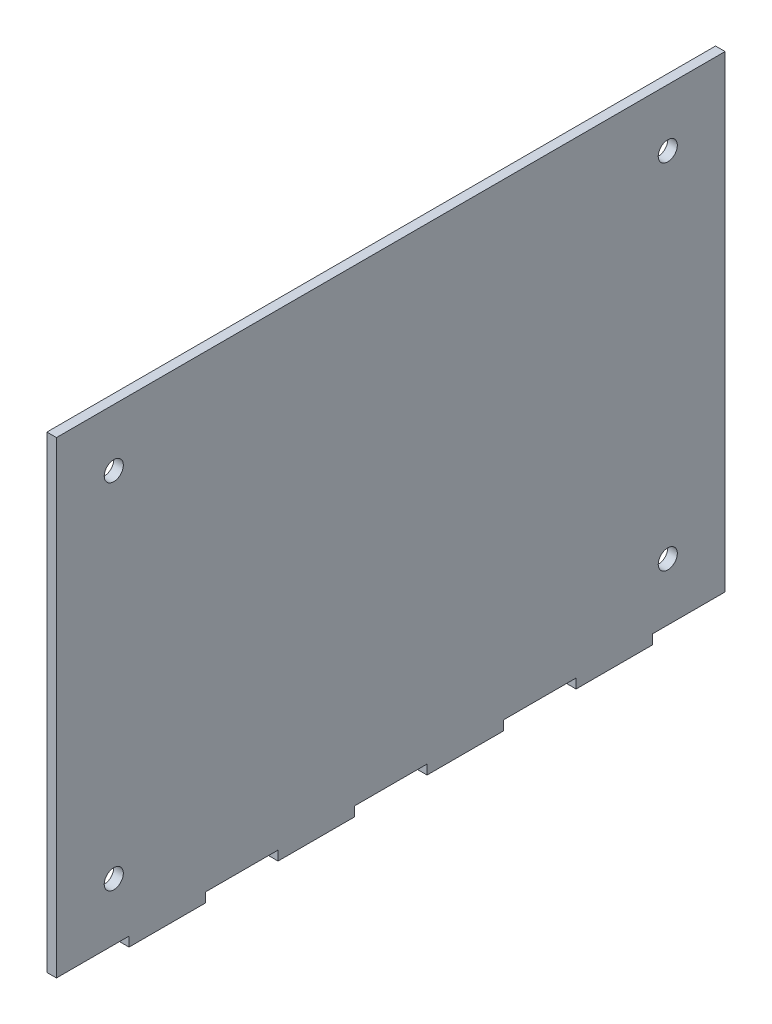
ISO-10303-21;
HEADER;
FILE_DESCRIPTION(('STEP AP214'),'2;1');
FILE_NAME('part.step','',(''),(''),'','','');
FILE_SCHEMA(('AUTOMOTIVE_DESIGN { 1 0 10303 214 1 1 1 1 }'));
ENDSEC;
DATA;
#1=APPLICATION_CONTEXT('core data for automotive mechanical design processes');
#2=APPLICATION_PROTOCOL_DEFINITION('international standard','automotive_design',2000,#1);
#3=PRODUCT_CONTEXT('',#1,'mechanical');
#4=PRODUCT('Part','Part','',(#3));
#5=PRODUCT_RELATED_PRODUCT_CATEGORY('part','',(#4));
#6=PRODUCT_DEFINITION_FORMATION('','',#4);
#7=PRODUCT_DEFINITION_CONTEXT('part definition',#1,'design');
#8=PRODUCT_DEFINITION('design','',#6,#7);
#9=PRODUCT_DEFINITION_SHAPE('','',#8);
#10=(LENGTH_UNIT() NAMED_UNIT(*) SI_UNIT(.MILLI.,.METRE.));
#11=(NAMED_UNIT(*) PLANE_ANGLE_UNIT() SI_UNIT($,.RADIAN.));
#12=(NAMED_UNIT(*) SI_UNIT($,.STERADIAN.) SOLID_ANGLE_UNIT());
#13=UNCERTAINTY_MEASURE_WITH_UNIT(LENGTH_MEASURE(1.E-05),#10,'distance_accuracy_value','');
#14=(GEOMETRIC_REPRESENTATION_CONTEXT(3) GLOBAL_UNCERTAINTY_ASSIGNED_CONTEXT((#13)) GLOBAL_UNIT_ASSIGNED_CONTEXT((#10,
#11,#12)) REPRESENTATION_CONTEXT('',''));
#15=CARTESIAN_POINT('',(0.,0.,0.));
#16=DIRECTION('',(0.,0.,1.));
#17=DIRECTION('',(1.,0.,0.));
#18=AXIS2_PLACEMENT_3D('',#15,#16,#17);
#19=CARTESIAN_POINT('',(5.,0.,-175.));
#20=DIRECTION('',(0.,1.,0.));
#21=DIRECTION('',(0.,0.,1.));
#22=AXIS2_PLACEMENT_3D('',#19,#20,#21);
#23=PLANE('',#22);
#24=DIRECTION('',(0.,0.,-1.));
#25=VECTOR('',#24,1.);
#26=CARTESIAN_POINT('',(5.,0.,-175.));
#27=LINE('',#26,#25);
#28=CARTESIAN_POINT('',(5.,0.,137.));
#29=VERTEX_POINT('',#28);
#30=CARTESIAN_POINT('',(5.,0.,97.));
#31=VERTEX_POINT('',#30);
#32=EDGE_CURVE('E187',#29,#31,#27,.T.);
#33=ORIENTED_EDGE('',*,*,#32,.F.);
#34=DIRECTION('',(1.,0.,0.));
#35=VECTOR('',#34,1.);
#36=CARTESIAN_POINT('',(0.,0.,137.));
#37=LINE('',#36,#35);
#38=CARTESIAN_POINT('',(0.,0.,137.));
#39=VERTEX_POINT('',#38);
#40=EDGE_CURVE('E174',#39,#29,#37,.T.);
#41=ORIENTED_EDGE('',*,*,#40,.F.);
#42=DIRECTION('',(0.,0.,-1.));
#43=VECTOR('',#42,1.);
#44=CARTESIAN_POINT('',(0.,0.,-175.));
#45=LINE('',#44,#43);
#46=CARTESIAN_POINT('',(0.,0.,97.));
#47=VERTEX_POINT('',#46);
#48=EDGE_CURVE('E185',#39,#47,#45,.T.);
#49=ORIENTED_EDGE('',*,*,#48,.T.);
#50=DIRECTION('',(1.,0.,0.));
#51=VECTOR('',#50,1.);
#52=CARTESIAN_POINT('',(0.,0.,97.));
#53=LINE('',#52,#51);
#54=EDGE_CURVE('E299',#47,#31,#53,.T.);
#55=ORIENTED_EDGE('',*,*,#54,.T.);
#56=EDGE_LOOP('',(#33,#41,#49,#55));
#57=FACE_BOUND('',#56,.T.);
#58=ADVANCED_FACE('F34',(#57),#23,.F.);
#59=CARTESIAN_POINT('',(5.,0.,-19.));
#60=VERTEX_POINT('',#59);
#61=CARTESIAN_POINT('',(5.,0.,-59.));
#62=VERTEX_POINT('',#61);
#63=EDGE_CURVE('E224',#60,#62,#27,.T.);
#64=ORIENTED_EDGE('',*,*,#63,.F.);
#65=DIRECTION('',(1.,0.,0.));
#66=VECTOR('',#65,1.);
#67=CARTESIAN_POINT('',(0.,0.,-19.));
#68=LINE('',#67,#66);
#69=CARTESIAN_POINT('',(0.,0.,-19.));
#70=VERTEX_POINT('',#69);
#71=EDGE_CURVE('E281',#70,#60,#68,.T.);
#72=ORIENTED_EDGE('',*,*,#71,.F.);
#73=CARTESIAN_POINT('',(0.,0.,-59.));
#74=VERTEX_POINT('',#73);
#75=EDGE_CURVE('E200',#70,#74,#45,.T.);
#76=ORIENTED_EDGE('',*,*,#75,.T.);
#77=DIRECTION('',(1.,0.,0.));
#78=VECTOR('',#77,1.);
#79=CARTESIAN_POINT('',(0.,0.,-59.));
#80=LINE('',#79,#78);
#81=EDGE_CURVE('E249',#74,#62,#80,.T.);
#82=ORIENTED_EDGE('',*,*,#81,.T.);
#83=EDGE_LOOP('',(#64,#72,#76,#82));
#84=FACE_BOUND('',#83,.T.);
#85=ADVANCED_FACE('F404',(#84),#23,.F.);
#86=CARTESIAN_POINT('',(5.,0.,-97.));
#87=VERTEX_POINT('',#86);
#88=CARTESIAN_POINT('',(5.,0.,-137.));
#89=VERTEX_POINT('',#88);
#90=EDGE_CURVE('E221',#87,#89,#27,.T.);
#91=ORIENTED_EDGE('',*,*,#90,.F.);
#92=DIRECTION('',(1.,0.,0.));
#93=VECTOR('',#92,1.);
#94=CARTESIAN_POINT('',(0.,0.,-97.));
#95=LINE('',#94,#93);
#96=CARTESIAN_POINT('',(0.,0.,-97.));
#97=VERTEX_POINT('',#96);
#98=EDGE_CURVE('E253',#97,#87,#95,.T.);
#99=ORIENTED_EDGE('',*,*,#98,.F.);
#100=CARTESIAN_POINT('',(0.,0.,-137.));
#101=VERTEX_POINT('',#100);
#102=EDGE_CURVE('E196',#97,#101,#45,.T.);
#103=ORIENTED_EDGE('',*,*,#102,.T.);
#104=DIRECTION('',(1.,0.,0.));
#105=VECTOR('',#104,1.);
#106=CARTESIAN_POINT('',(0.,0.,-137.));
#107=LINE('',#106,#105);
#108=EDGE_CURVE('E230',#101,#89,#107,.T.);
#109=ORIENTED_EDGE('',*,*,#108,.T.);
#110=EDGE_LOOP('',(#91,#99,#103,#109));
#111=FACE_BOUND('',#110,.T.);
#112=ADVANCED_FACE('F389',(#111),#23,.F.);
#113=CARTESIAN_POINT('',(5.,0.,175.));
#114=DIRECTION('',(0.,0.,-1.));
#115=DIRECTION('',(0.,1.,0.));
#116=AXIS2_PLACEMENT_3D('',#113,#114,#115);
#117=PLANE('',#116);
#118=DIRECTION('',(0.,-1.,0.));
#119=VECTOR('',#118,1.);
#120=CARTESIAN_POINT('',(0.,0.,175.));
#121=LINE('',#120,#119);
#122=CARTESIAN_POINT('',(0.,250.,175.));
#123=VERTEX_POINT('',#122);
#124=CARTESIAN_POINT('',(0.,5.,175.));
#125=VERTEX_POINT('',#124);
#126=EDGE_CURVE('E203',#123,#125,#121,.T.);
#127=ORIENTED_EDGE('',*,*,#126,.T.);
#128=DIRECTION('',(1.,0.,0.));
#129=VECTOR('',#128,1.);
#130=CARTESIAN_POINT('',(0.,5.,175.));
#131=LINE('',#130,#129);
#132=CARTESIAN_POINT('',(5.,5.,175.));
#133=VERTEX_POINT('',#132);
#134=EDGE_CURVE('E210',#125,#133,#131,.T.);
#135=ORIENTED_EDGE('',*,*,#134,.T.);
#136=DIRECTION('',(0.,-1.,0.));
#137=VECTOR('',#136,1.);
#138=CARTESIAN_POINT('',(5.,0.,175.));
#139=LINE('',#138,#137);
#140=CARTESIAN_POINT('',(5.,250.,175.));
#141=VERTEX_POINT('',#140);
#142=EDGE_CURVE('E225',#141,#133,#139,.T.);
#143=ORIENTED_EDGE('',*,*,#142,.F.);
#144=DIRECTION('',(-1.,0.,0.));
#145=VECTOR('',#144,1.);
#146=CARTESIAN_POINT('',(5.,250.,175.));
#147=LINE('',#146,#145);
#148=EDGE_CURVE('E42',#141,#123,#147,.T.);
#149=ORIENTED_EDGE('',*,*,#148,.T.);
#150=EDGE_LOOP('',(#127,#135,#143,#149));
#151=FACE_BOUND('',#150,.T.);
#152=ADVANCED_FACE('F36',(#151),#117,.F.);
#153=CARTESIAN_POINT('',(5.,0.,59.));
#154=VERTEX_POINT('',#153);
#155=CARTESIAN_POINT('',(5.,0.,19.));
#156=VERTEX_POINT('',#155);
#157=EDGE_CURVE('E422',#154,#156,#27,.T.);
#158=ORIENTED_EDGE('',*,*,#157,.F.);
#159=DIRECTION('',(1.,0.,0.));
#160=VECTOR('',#159,1.);
#161=CARTESIAN_POINT('',(0.,0.,59.));
#162=LINE('',#161,#160);
#163=CARTESIAN_POINT('',(0.,0.,59.));
#164=VERTEX_POINT('',#163);
#165=EDGE_CURVE('E301',#164,#154,#162,.T.);
#166=ORIENTED_EDGE('',*,*,#165,.F.);
#167=CARTESIAN_POINT('',(0.,0.,19.));
#168=VERTEX_POINT('',#167);
#169=EDGE_CURVE('E194',#164,#168,#45,.T.);
#170=ORIENTED_EDGE('',*,*,#169,.T.);
#171=DIRECTION('',(1.,0.,0.));
#172=VECTOR('',#171,1.);
#173=CARTESIAN_POINT('',(0.,0.,19.));
#174=LINE('',#173,#172);
#175=EDGE_CURVE('E278',#168,#156,#174,.T.);
#176=ORIENTED_EDGE('',*,*,#175,.T.);
#177=EDGE_LOOP('',(#158,#166,#170,#176));
#178=FACE_BOUND('',#177,.T.);
#179=ADVANCED_FACE('F421',(#178),#23,.F.);
#180=CARTESIAN_POINT('',(5.,0.,-175.));
#181=DIRECTION('',(0.,0.,1.));
#182=DIRECTION('',(0.,-1.,0.));
#183=AXIS2_PLACEMENT_3D('',#180,#181,#182);
#184=PLANE('',#183);
#185=DIRECTION('',(0.,1.,0.));
#186=VECTOR('',#185,1.);
#187=CARTESIAN_POINT('',(5.,0.,-175.));
#188=LINE('',#187,#186);
#189=CARTESIAN_POINT('',(5.,5.,-175.));
#190=VERTEX_POINT('',#189);
#191=CARTESIAN_POINT('',(5.,250.,-175.));
#192=VERTEX_POINT('',#191);
#193=EDGE_CURVE('E219',#190,#192,#188,.T.);
#194=ORIENTED_EDGE('',*,*,#193,.F.);
#195=DIRECTION('',(1.,0.,0.));
#196=VECTOR('',#195,1.);
#197=CARTESIAN_POINT('',(0.,5.,-175.));
#198=LINE('',#197,#196);
#199=CARTESIAN_POINT('',(0.,5.,-175.));
#200=VERTEX_POINT('',#199);
#201=EDGE_CURVE('E233',#200,#190,#198,.T.);
#202=ORIENTED_EDGE('',*,*,#201,.F.);
#203=DIRECTION('',(0.,1.,0.));
#204=VECTOR('',#203,1.);
#205=CARTESIAN_POINT('',(0.,0.,-175.));
#206=LINE('',#205,#204);
#207=CARTESIAN_POINT('',(0.,250.,-175.));
#208=VERTEX_POINT('',#207);
#209=EDGE_CURVE('E193',#200,#208,#206,.T.);
#210=ORIENTED_EDGE('',*,*,#209,.T.);
#211=DIRECTION('',(-1.,0.,0.));
#212=VECTOR('',#211,1.);
#213=CARTESIAN_POINT('',(5.,250.,-175.));
#214=LINE('',#213,#212);
#215=EDGE_CURVE('E11',#192,#208,#214,.T.);
#216=ORIENTED_EDGE('',*,*,#215,.F.);
#217=EDGE_LOOP('',(#194,#202,#210,#216));
#218=FACE_BOUND('',#217,.T.);
#219=ADVANCED_FACE('F378',(#218),#184,.F.);
#220=CARTESIAN_POINT('',(5.,250.,175.));
#221=DIRECTION('',(0.,-1.,0.));
#222=DIRECTION('',(0.,0.,-1.));
#223=AXIS2_PLACEMENT_3D('',#220,#221,#222);
#224=PLANE('',#223);
#225=DIRECTION('',(0.,0.,1.));
#226=VECTOR('',#225,1.);
#227=CARTESIAN_POINT('',(0.,250.,175.));
#228=LINE('',#227,#226);
#229=EDGE_CURVE('E197',#208,#123,#228,.T.);
#230=ORIENTED_EDGE('',*,*,#229,.T.);
#231=ORIENTED_EDGE('',*,*,#148,.F.);
#232=DIRECTION('',(0.,0.,1.));
#233=VECTOR('',#232,1.);
#234=CARTESIAN_POINT('',(5.,250.,175.));
#235=LINE('',#234,#233);
#236=EDGE_CURVE('E217',#192,#141,#235,.T.);
#237=ORIENTED_EDGE('',*,*,#236,.F.);
#238=ORIENTED_EDGE('',*,*,#215,.T.);
#239=EDGE_LOOP('',(#230,#231,#237,#238));
#240=FACE_BOUND('',#239,.T.);
#241=ADVANCED_FACE('F361',(#240),#224,.F.);
#242=CARTESIAN_POINT('',(5.,0.,0.));
#243=DIRECTION('',(-1.,0.,0.));
#244=DIRECTION('',(0.,0.,1.));
#245=AXIS2_PLACEMENT_3D('',#242,#243,#244);
#246=PLANE('',#245);
#247=CARTESIAN_POINT('',(5.,35.,-145.));
#248=DIRECTION('',(1.,0.,0.));
#249=DIRECTION('',(0.,0.,1.));
#250=AXIS2_PLACEMENT_3D('',#247,#248,#249);
#251=CIRCLE('',#250,5.00000000000002);
#252=CARTESIAN_POINT('',(5.,35.,-140.));
#253=VERTEX_POINT('',#252);
#254=EDGE_CURVE('E330',#253,#253,#251,.T.);
#255=ORIENTED_EDGE('',*,*,#254,.F.);
#256=EDGE_LOOP('',(#255));
#257=FACE_BOUND('',#256,.T.);
#258=CARTESIAN_POINT('',(5.,35.,145.));
#259=DIRECTION('',(1.,0.,0.));
#260=DIRECTION('',(0.,0.,-1.));
#261=AXIS2_PLACEMENT_3D('',#258,#259,#260);
#262=CIRCLE('',#261,5.00000000000002);
#263=CARTESIAN_POINT('',(5.,35.,140.));
#264=VERTEX_POINT('',#263);
#265=EDGE_CURVE('E336',#264,#264,#262,.T.);
#266=ORIENTED_EDGE('',*,*,#265,.F.);
#267=EDGE_LOOP('',(#266));
#268=FACE_BOUND('',#267,.T.);
#269=CARTESIAN_POINT('',(5.,220.,145.));
#270=DIRECTION('',(1.,0.,0.));
#271=DIRECTION('',(0.,0.,1.));
#272=AXIS2_PLACEMENT_3D('',#269,#270,#271);
#273=CIRCLE('',#272,5.00000000000002);
#274=CARTESIAN_POINT('',(5.,220.,150.));
#275=VERTEX_POINT('',#274);
#276=EDGE_CURVE('E342',#275,#275,#273,.T.);
#277=ORIENTED_EDGE('',*,*,#276,.F.);
#278=EDGE_LOOP('',(#277));
#279=FACE_BOUND('',#278,.T.);
#280=CARTESIAN_POINT('',(5.,220.,-145.));
#281=DIRECTION('',(1.,0.,0.));
#282=DIRECTION('',(0.,0.,-1.));
#283=AXIS2_PLACEMENT_3D('',#280,#281,#282);
#284=CIRCLE('',#283,5.00000000000002);
#285=CARTESIAN_POINT('',(5.,220.,-150.));
#286=VERTEX_POINT('',#285);
#287=EDGE_CURVE('E324',#286,#286,#284,.T.);
#288=ORIENTED_EDGE('',*,*,#287,.F.);
#289=EDGE_LOOP('',(#288));
#290=FACE_BOUND('',#289,.T.);
#291=ORIENTED_EDGE('',*,*,#142,.T.);
#292=DIRECTION('',(0.,0.,1.));
#293=VECTOR('',#292,1.);
#294=CARTESIAN_POINT('',(5.,5.,175.));
#295=LINE('',#294,#293);
#296=CARTESIAN_POINT('',(5.,5.,137.));
#297=VERTEX_POINT('',#296);
#298=EDGE_CURVE('E179',#297,#133,#295,.T.);
#299=ORIENTED_EDGE('',*,*,#298,.F.);
#300=DIRECTION('',(0.,1.,0.));
#301=VECTOR('',#300,1.);
#302=CARTESIAN_POINT('',(5.,0.,137.));
#303=LINE('',#302,#301);
#304=EDGE_CURVE('E307',#29,#297,#303,.T.);
#305=ORIENTED_EDGE('',*,*,#304,.F.);
#306=ORIENTED_EDGE('',*,*,#32,.T.);
#307=DIRECTION('',(0.,-1.,0.));
#308=VECTOR('',#307,1.);
#309=CARTESIAN_POINT('',(5.,0.,97.));
#310=LINE('',#309,#308);
#311=CARTESIAN_POINT('',(5.,5.,97.));
#312=VERTEX_POINT('',#311);
#313=EDGE_CURVE('E283',#312,#31,#310,.T.);
#314=ORIENTED_EDGE('',*,*,#313,.F.);
#315=DIRECTION('',(0.,0.,1.));
#316=VECTOR('',#315,1.);
#317=CARTESIAN_POINT('',(5.,5.,97.));
#318=LINE('',#317,#316);
#319=CARTESIAN_POINT('',(5.,5.,59.));
#320=VERTEX_POINT('',#319);
#321=EDGE_CURVE('E308',#320,#312,#318,.T.);
#322=ORIENTED_EDGE('',*,*,#321,.F.);
#323=DIRECTION('',(0.,1.,0.));
#324=VECTOR('',#323,1.);
#325=CARTESIAN_POINT('',(5.,0.,59.));
#326=LINE('',#325,#324);
#327=EDGE_CURVE('E311',#154,#320,#326,.T.);
#328=ORIENTED_EDGE('',*,*,#327,.F.);
#329=ORIENTED_EDGE('',*,*,#157,.T.);
#330=DIRECTION('',(0.,-1.,0.));
#331=VECTOR('',#330,1.);
#332=CARTESIAN_POINT('',(5.,0.,19.));
#333=LINE('',#332,#331);
#334=CARTESIAN_POINT('',(5.,5.,19.));
#335=VERTEX_POINT('',#334);
#336=EDGE_CURVE('E284',#335,#156,#333,.T.);
#337=ORIENTED_EDGE('',*,*,#336,.F.);
#338=DIRECTION('',(0.,0.,1.));
#339=VECTOR('',#338,1.);
#340=CARTESIAN_POINT('',(5.,5.,19.));
#341=LINE('',#340,#339);
#342=CARTESIAN_POINT('',(5.,5.,-19.));
#343=VERTEX_POINT('',#342);
#344=EDGE_CURVE('E287',#343,#335,#341,.T.);
#345=ORIENTED_EDGE('',*,*,#344,.F.);
#346=DIRECTION('',(0.,1.,0.));
#347=VECTOR('',#346,1.);
#348=CARTESIAN_POINT('',(5.,0.,-19.));
#349=LINE('',#348,#347);
#350=EDGE_CURVE('E257',#60,#343,#349,.T.);
#351=ORIENTED_EDGE('',*,*,#350,.F.);
#352=ORIENTED_EDGE('',*,*,#63,.T.);
#353=DIRECTION('',(0.,-1.,0.));
#354=VECTOR('',#353,1.);
#355=CARTESIAN_POINT('',(5.,0.,-59.));
#356=LINE('',#355,#354);
#357=CARTESIAN_POINT('',(5.,5.,-59.));
#358=VERTEX_POINT('',#357);
#359=EDGE_CURVE('E262',#358,#62,#356,.T.);
#360=ORIENTED_EDGE('',*,*,#359,.F.);
#361=DIRECTION('',(0.,0.,1.));
#362=VECTOR('',#361,1.);
#363=CARTESIAN_POINT('',(5.,5.,-97.));
#364=LINE('',#363,#362);
#365=CARTESIAN_POINT('',(5.,5.,-97.));
#366=VERTEX_POINT('',#365);
#367=EDGE_CURVE('E235',#366,#358,#364,.T.);
#368=ORIENTED_EDGE('',*,*,#367,.F.);
#369=DIRECTION('',(0.,1.,0.));
#370=VECTOR('',#369,1.);
#371=CARTESIAN_POINT('',(5.,0.,-97.));
#372=LINE('',#371,#370);
#373=EDGE_CURVE('E258',#87,#366,#372,.T.);
#374=ORIENTED_EDGE('',*,*,#373,.F.);
#375=ORIENTED_EDGE('',*,*,#90,.T.);
#376=DIRECTION('',(0.,-1.,0.));
#377=VECTOR('',#376,1.);
#378=CARTESIAN_POINT('',(5.,0.,-137.));
#379=LINE('',#378,#377);
#380=CARTESIAN_POINT('',(5.,5.,-137.));
#381=VERTEX_POINT('',#380);
#382=EDGE_CURVE('E236',#381,#89,#379,.T.);
#383=ORIENTED_EDGE('',*,*,#382,.F.);
#384=DIRECTION('',(0.,0.,1.));
#385=VECTOR('',#384,1.);
#386=CARTESIAN_POINT('',(5.,5.,-175.));
#387=LINE('',#386,#385);
#388=EDGE_CURVE('E239',#190,#381,#387,.T.);
#389=ORIENTED_EDGE('',*,*,#388,.F.);
#390=ORIENTED_EDGE('',*,*,#193,.T.);
#391=ORIENTED_EDGE('',*,*,#236,.T.);
#392=EDGE_LOOP('',(#291,#299,#305,#306,#314,#322,#328,#329,#337,#345,#351,#352,#360,#368,#374,
#375,#383,#389,#390,#391));
#393=FACE_BOUND('',#392,.T.);
#394=ADVANCED_FACE('F358',(#257,#268,#279,#290,#393),#246,.F.);
#395=CARTESIAN_POINT('',(0.,0.,0.));
#396=DIRECTION('',(-1.,0.,0.));
#397=DIRECTION('',(0.,0.,1.));
#398=AXIS2_PLACEMENT_3D('',#395,#396,#397);
#399=PLANE('',#398);
#400=CARTESIAN_POINT('',(0.,35.,-145.));
#401=DIRECTION('',(1.,0.,0.));
#402=DIRECTION('',(0.,0.,1.));
#403=AXIS2_PLACEMENT_3D('',#400,#401,#402);
#404=CIRCLE('',#403,5.00000000000002);
#405=CARTESIAN_POINT('',(0.,35.,-140.));
#406=VERTEX_POINT('',#405);
#407=EDGE_CURVE('E333',#406,#406,#404,.T.);
#408=ORIENTED_EDGE('',*,*,#407,.T.);
#409=EDGE_LOOP('',(#408));
#410=FACE_BOUND('',#409,.T.);
#411=CARTESIAN_POINT('',(0.,35.,145.));
#412=DIRECTION('',(1.,0.,0.));
#413=DIRECTION('',(0.,0.,-1.));
#414=AXIS2_PLACEMENT_3D('',#411,#412,#413);
#415=CIRCLE('',#414,5.00000000000002);
#416=CARTESIAN_POINT('',(0.,35.,140.));
#417=VERTEX_POINT('',#416);
#418=EDGE_CURVE('E339',#417,#417,#415,.T.);
#419=ORIENTED_EDGE('',*,*,#418,.T.);
#420=EDGE_LOOP('',(#419));
#421=FACE_BOUND('',#420,.T.);
#422=CARTESIAN_POINT('',(0.,220.,145.));
#423=DIRECTION('',(1.,0.,0.));
#424=DIRECTION('',(0.,0.,1.));
#425=AXIS2_PLACEMENT_3D('',#422,#423,#424);
#426=CIRCLE('',#425,5.00000000000002);
#427=CARTESIAN_POINT('',(0.,220.,150.));
#428=VERTEX_POINT('',#427);
#429=EDGE_CURVE('E327',#428,#428,#426,.T.);
#430=ORIENTED_EDGE('',*,*,#429,.T.);
#431=EDGE_LOOP('',(#430));
#432=FACE_BOUND('',#431,.T.);
#433=CARTESIAN_POINT('',(0.,220.,-145.));
#434=DIRECTION('',(1.,0.,0.));
#435=DIRECTION('',(0.,0.,-1.));
#436=AXIS2_PLACEMENT_3D('',#433,#434,#435);
#437=CIRCLE('',#436,5.00000000000002);
#438=CARTESIAN_POINT('',(0.,220.,-150.));
#439=VERTEX_POINT('',#438);
#440=EDGE_CURVE('E242',#439,#439,#437,.T.);
#441=ORIENTED_EDGE('',*,*,#440,.T.);
#442=EDGE_LOOP('',(#441));
#443=FACE_BOUND('',#442,.T.);
#444=DIRECTION('',(0.,0.,1.));
#445=VECTOR('',#444,1.);
#446=CARTESIAN_POINT('',(0.,5.,175.));
#447=LINE('',#446,#445);
#448=CARTESIAN_POINT('',(0.,5.,137.));
#449=VERTEX_POINT('',#448);
#450=EDGE_CURVE('E49',#449,#125,#447,.T.);
#451=ORIENTED_EDGE('',*,*,#450,.T.);
#452=ORIENTED_EDGE('',*,*,#126,.F.);
#453=ORIENTED_EDGE('',*,*,#229,.F.);
#454=ORIENTED_EDGE('',*,*,#209,.F.);
#455=DIRECTION('',(0.,0.,1.));
#456=VECTOR('',#455,1.);
#457=CARTESIAN_POINT('',(0.,5.,-175.));
#458=LINE('',#457,#456);
#459=CARTESIAN_POINT('',(0.,5.,-137.));
#460=VERTEX_POINT('',#459);
#461=EDGE_CURVE('E238',#200,#460,#458,.T.);
#462=ORIENTED_EDGE('',*,*,#461,.T.);
#463=DIRECTION('',(0.,-1.,0.));
#464=VECTOR('',#463,1.);
#465=CARTESIAN_POINT('',(0.,0.,-137.));
#466=LINE('',#465,#464);
#467=EDGE_CURVE('E231',#460,#101,#466,.T.);
#468=ORIENTED_EDGE('',*,*,#467,.T.);
#469=ORIENTED_EDGE('',*,*,#102,.F.);
#470=DIRECTION('',(0.,1.,0.));
#471=VECTOR('',#470,1.);
#472=CARTESIAN_POINT('',(0.,0.,-97.));
#473=LINE('',#472,#471);
#474=CARTESIAN_POINT('',(0.,5.,-97.));
#475=VERTEX_POINT('',#474);
#476=EDGE_CURVE('E250',#97,#475,#473,.T.);
#477=ORIENTED_EDGE('',*,*,#476,.T.);
#478=DIRECTION('',(0.,0.,1.));
#479=VECTOR('',#478,1.);
#480=CARTESIAN_POINT('',(0.,5.,-97.));
#481=LINE('',#480,#479);
#482=CARTESIAN_POINT('',(0.,5.,-59.));
#483=VERTEX_POINT('',#482);
#484=EDGE_CURVE('E261',#475,#483,#481,.T.);
#485=ORIENTED_EDGE('',*,*,#484,.T.);
#486=DIRECTION('',(0.,-1.,0.));
#487=VECTOR('',#486,1.);
#488=CARTESIAN_POINT('',(0.,0.,-59.));
#489=LINE('',#488,#487);
#490=EDGE_CURVE('E268',#483,#74,#489,.T.);
#491=ORIENTED_EDGE('',*,*,#490,.T.);
#492=ORIENTED_EDGE('',*,*,#75,.F.);
#493=DIRECTION('',(0.,1.,0.));
#494=VECTOR('',#493,1.);
#495=CARTESIAN_POINT('',(0.,0.,-19.));
#496=LINE('',#495,#494);
#497=CARTESIAN_POINT('',(0.,5.,-19.));
#498=VERTEX_POINT('',#497);
#499=EDGE_CURVE('E286',#70,#498,#496,.T.);
#500=ORIENTED_EDGE('',*,*,#499,.T.);
#501=DIRECTION('',(0.,0.,1.));
#502=VECTOR('',#501,1.);
#503=CARTESIAN_POINT('',(0.,5.,19.));
#504=LINE('',#503,#502);
#505=CARTESIAN_POINT('',(0.,5.,19.));
#506=VERTEX_POINT('',#505);
#507=EDGE_CURVE('E294',#498,#506,#504,.T.);
#508=ORIENTED_EDGE('',*,*,#507,.T.);
#509=DIRECTION('',(0.,-1.,0.));
#510=VECTOR('',#509,1.);
#511=CARTESIAN_POINT('',(0.,0.,19.));
#512=LINE('',#511,#510);
#513=EDGE_CURVE('E276',#506,#168,#512,.T.);
#514=ORIENTED_EDGE('',*,*,#513,.T.);
#515=ORIENTED_EDGE('',*,*,#169,.F.);
#516=DIRECTION('',(0.,1.,0.));
#517=VECTOR('',#516,1.);
#518=CARTESIAN_POINT('',(0.,0.,59.));
#519=LINE('',#518,#517);
#520=CARTESIAN_POINT('',(0.,5.,59.));
#521=VERTEX_POINT('',#520);
#522=EDGE_CURVE('E316',#164,#521,#519,.T.);
#523=ORIENTED_EDGE('',*,*,#522,.T.);
#524=DIRECTION('',(0.,0.,1.));
#525=VECTOR('',#524,1.);
#526=CARTESIAN_POINT('',(0.,5.,97.));
#527=LINE('',#526,#525);
#528=CARTESIAN_POINT('',(0.,5.,97.));
#529=VERTEX_POINT('',#528);
#530=EDGE_CURVE('E57',#521,#529,#527,.T.);
#531=ORIENTED_EDGE('',*,*,#530,.T.);
#532=DIRECTION('',(0.,-1.,0.));
#533=VECTOR('',#532,1.);
#534=CARTESIAN_POINT('',(0.,0.,97.));
#535=LINE('',#534,#533);
#536=EDGE_CURVE('E192',#529,#47,#535,.T.);
#537=ORIENTED_EDGE('',*,*,#536,.T.);
#538=ORIENTED_EDGE('',*,*,#48,.F.);
#539=DIRECTION('',(0.,1.,0.));
#540=VECTOR('',#539,1.);
#541=CARTESIAN_POINT('',(0.,0.,137.));
#542=LINE('',#541,#540);
#543=EDGE_CURVE('E170',#39,#449,#542,.T.);
#544=ORIENTED_EDGE('',*,*,#543,.T.);
#545=EDGE_LOOP('',(#451,#452,#453,#454,#462,#468,#469,#477,#485,#491,#492,#500,#508,#514,#515,
#523,#531,#537,#538,#544));
#546=FACE_BOUND('',#545,.T.);
#547=ADVANCED_FACE('F190',(#410,#421,#432,#443,#546),#399,.T.);
#548=CARTESIAN_POINT('',(0.,5.,-175.));
#549=DIRECTION('',(0.,1.,0.));
#550=DIRECTION('',(0.,0.,1.));
#551=AXIS2_PLACEMENT_3D('',#548,#549,#550);
#552=PLANE('',#551);
#553=ORIENTED_EDGE('',*,*,#388,.T.);
#554=DIRECTION('',(1.,0.,0.));
#555=VECTOR('',#554,1.);
#556=CARTESIAN_POINT('',(0.,5.,-137.));
#557=LINE('',#556,#555);
#558=EDGE_CURVE('E228',#460,#381,#557,.T.);
#559=ORIENTED_EDGE('',*,*,#558,.F.);
#560=ORIENTED_EDGE('',*,*,#461,.F.);
#561=ORIENTED_EDGE('',*,*,#201,.T.);
#562=EDGE_LOOP('',(#553,#559,#560,#561));
#563=FACE_BOUND('',#562,.T.);
#564=ADVANCED_FACE('F382',(#563),#552,.F.);
#565=CARTESIAN_POINT('',(0.,0.,-137.));
#566=DIRECTION('',(0.,0.,1.));
#567=DIRECTION('',(1.,0.,0.));
#568=AXIS2_PLACEMENT_3D('',#565,#566,#567);
#569=PLANE('',#568);
#570=ORIENTED_EDGE('',*,*,#382,.T.);
#571=ORIENTED_EDGE('',*,*,#108,.F.);
#572=ORIENTED_EDGE('',*,*,#467,.F.);
#573=ORIENTED_EDGE('',*,*,#558,.T.);
#574=EDGE_LOOP('',(#570,#571,#572,#573));
#575=FACE_BOUND('',#574,.T.);
#576=ADVANCED_FACE('F387',(#575),#569,.F.);
#577=CARTESIAN_POINT('',(0.,5.,-97.));
#578=DIRECTION('',(0.,1.,0.));
#579=DIRECTION('',(0.,0.,1.));
#580=AXIS2_PLACEMENT_3D('',#577,#578,#579);
#581=PLANE('',#580);
#582=ORIENTED_EDGE('',*,*,#367,.T.);
#583=DIRECTION('',(1.,0.,0.));
#584=VECTOR('',#583,1.);
#585=CARTESIAN_POINT('',(0.,5.,-59.));
#586=LINE('',#585,#584);
#587=EDGE_CURVE('E247',#483,#358,#586,.T.);
#588=ORIENTED_EDGE('',*,*,#587,.F.);
#589=ORIENTED_EDGE('',*,*,#484,.F.);
#590=DIRECTION('',(1.,0.,0.));
#591=VECTOR('',#590,1.);
#592=CARTESIAN_POINT('',(0.,5.,-97.));
#593=LINE('',#592,#591);
#594=EDGE_CURVE('E255',#475,#366,#593,.T.);
#595=ORIENTED_EDGE('',*,*,#594,.T.);
#596=EDGE_LOOP('',(#582,#588,#589,#595));
#597=FACE_BOUND('',#596,.T.);
#598=ADVANCED_FACE('F395',(#597),#581,.F.);
#599=CARTESIAN_POINT('',(0.,0.,-97.));
#600=DIRECTION('',(0.,0.,-1.));
#601=DIRECTION('',(-1.,0.,0.));
#602=AXIS2_PLACEMENT_3D('',#599,#600,#601);
#603=PLANE('',#602);
#604=ORIENTED_EDGE('',*,*,#373,.T.);
#605=ORIENTED_EDGE('',*,*,#594,.F.);
#606=ORIENTED_EDGE('',*,*,#476,.F.);
#607=ORIENTED_EDGE('',*,*,#98,.T.);
#608=EDGE_LOOP('',(#604,#605,#606,#607));
#609=FACE_BOUND('',#608,.T.);
#610=ADVANCED_FACE('F392',(#609),#603,.F.);
#611=CARTESIAN_POINT('',(0.,0.,-59.));
#612=DIRECTION('',(0.,0.,1.));
#613=DIRECTION('',(1.,0.,0.));
#614=AXIS2_PLACEMENT_3D('',#611,#612,#613);
#615=PLANE('',#614);
#616=ORIENTED_EDGE('',*,*,#359,.T.);
#617=ORIENTED_EDGE('',*,*,#81,.F.);
#618=ORIENTED_EDGE('',*,*,#490,.F.);
#619=ORIENTED_EDGE('',*,*,#587,.T.);
#620=EDGE_LOOP('',(#616,#617,#618,#619));
#621=FACE_BOUND('',#620,.T.);
#622=ADVANCED_FACE('F399',(#621),#615,.F.);
#623=CARTESIAN_POINT('',(0.,0.,-19.));
#624=DIRECTION('',(0.,0.,-1.));
#625=DIRECTION('',(0.,1.,0.));
#626=AXIS2_PLACEMENT_3D('',#623,#624,#625);
#627=PLANE('',#626);
#628=ORIENTED_EDGE('',*,*,#350,.T.);
#629=DIRECTION('',(1.,0.,0.));
#630=VECTOR('',#629,1.);
#631=CARTESIAN_POINT('',(0.,5.,-19.));
#632=LINE('',#631,#630);
#633=EDGE_CURVE('E273',#498,#343,#632,.T.);
#634=ORIENTED_EDGE('',*,*,#633,.F.);
#635=ORIENTED_EDGE('',*,*,#499,.F.);
#636=ORIENTED_EDGE('',*,*,#71,.T.);
#637=EDGE_LOOP('',(#628,#634,#635,#636));
#638=FACE_BOUND('',#637,.T.);
#639=ADVANCED_FACE('F408',(#638),#627,.F.);
#640=CARTESIAN_POINT('',(0.,0.,19.));
#641=DIRECTION('',(0.,0.,1.));
#642=DIRECTION('',(0.,-1.,0.));
#643=AXIS2_PLACEMENT_3D('',#640,#641,#642);
#644=PLANE('',#643);
#645=ORIENTED_EDGE('',*,*,#336,.T.);
#646=ORIENTED_EDGE('',*,*,#175,.F.);
#647=ORIENTED_EDGE('',*,*,#513,.F.);
#648=DIRECTION('',(1.,0.,0.));
#649=VECTOR('',#648,1.);
#650=CARTESIAN_POINT('',(0.,5.,19.));
#651=LINE('',#650,#649);
#652=EDGE_CURVE('E275',#506,#335,#651,.T.);
#653=ORIENTED_EDGE('',*,*,#652,.T.);
#654=EDGE_LOOP('',(#645,#646,#647,#653));
#655=FACE_BOUND('',#654,.T.);
#656=ADVANCED_FACE('F438',(#655),#644,.F.);
#657=CARTESIAN_POINT('',(0.,5.,19.));
#658=DIRECTION('',(0.,1.,0.));
#659=DIRECTION('',(0.,0.,1.));
#660=AXIS2_PLACEMENT_3D('',#657,#658,#659);
#661=PLANE('',#660);
#662=ORIENTED_EDGE('',*,*,#344,.T.);
#663=ORIENTED_EDGE('',*,*,#652,.F.);
#664=ORIENTED_EDGE('',*,*,#507,.F.);
#665=ORIENTED_EDGE('',*,*,#633,.T.);
#666=EDGE_LOOP('',(#662,#663,#664,#665));
#667=FACE_BOUND('',#666,.T.);
#668=ADVANCED_FACE('F414',(#667),#661,.F.);
#669=CARTESIAN_POINT('',(0.,0.,97.));
#670=DIRECTION('',(0.,0.,1.));
#671=DIRECTION('',(1.,0.,0.));
#672=AXIS2_PLACEMENT_3D('',#669,#670,#671);
#673=PLANE('',#672);
#674=ORIENTED_EDGE('',*,*,#313,.T.);
#675=ORIENTED_EDGE('',*,*,#54,.F.);
#676=ORIENTED_EDGE('',*,*,#536,.F.);
#677=DIRECTION('',(1.,0.,0.));
#678=VECTOR('',#677,1.);
#679=CARTESIAN_POINT('',(0.,5.,97.));
#680=LINE('',#679,#678);
#681=EDGE_CURVE('E305',#529,#312,#680,.T.);
#682=ORIENTED_EDGE('',*,*,#681,.T.);
#683=EDGE_LOOP('',(#674,#675,#676,#682));
#684=FACE_BOUND('',#683,.T.);
#685=ADVANCED_FACE('F430',(#684),#673,.F.);
#686=CARTESIAN_POINT('',(0.,5.,97.));
#687=DIRECTION('',(0.,1.,0.));
#688=DIRECTION('',(0.,0.,1.));
#689=AXIS2_PLACEMENT_3D('',#686,#687,#688);
#690=PLANE('',#689);
#691=ORIENTED_EDGE('',*,*,#321,.T.);
#692=ORIENTED_EDGE('',*,*,#681,.F.);
#693=ORIENTED_EDGE('',*,*,#530,.F.);
#694=DIRECTION('',(1.,0.,0.));
#695=VECTOR('',#694,1.);
#696=CARTESIAN_POINT('',(0.,5.,59.));
#697=LINE('',#696,#695);
#698=EDGE_CURVE('E303',#521,#320,#697,.T.);
#699=ORIENTED_EDGE('',*,*,#698,.T.);
#700=EDGE_LOOP('',(#691,#692,#693,#699));
#701=FACE_BOUND('',#700,.T.);
#702=ADVANCED_FACE('F428',(#701),#690,.F.);
#703=CARTESIAN_POINT('',(0.,0.,59.));
#704=DIRECTION('',(0.,0.,-1.));
#705=DIRECTION('',(-1.,0.,0.));
#706=AXIS2_PLACEMENT_3D('',#703,#704,#705);
#707=PLANE('',#706);
#708=ORIENTED_EDGE('',*,*,#327,.T.);
#709=ORIENTED_EDGE('',*,*,#698,.F.);
#710=ORIENTED_EDGE('',*,*,#522,.F.);
#711=ORIENTED_EDGE('',*,*,#165,.T.);
#712=EDGE_LOOP('',(#708,#709,#710,#711));
#713=FACE_BOUND('',#712,.T.);
#714=ADVANCED_FACE('F425',(#713),#707,.F.);
#715=CARTESIAN_POINT('',(0.,5.,175.));
#716=DIRECTION('',(0.,1.,0.));
#717=DIRECTION('',(0.,0.,1.));
#718=AXIS2_PLACEMENT_3D('',#715,#716,#717);
#719=PLANE('',#718);
#720=ORIENTED_EDGE('',*,*,#298,.T.);
#721=ORIENTED_EDGE('',*,*,#134,.F.);
#722=ORIENTED_EDGE('',*,*,#450,.F.);
#723=DIRECTION('',(1.,0.,0.));
#724=VECTOR('',#723,1.);
#725=CARTESIAN_POINT('',(0.,5.,137.));
#726=LINE('',#725,#724);
#727=EDGE_CURVE('E176',#449,#297,#726,.T.);
#728=ORIENTED_EDGE('',*,*,#727,.T.);
#729=EDGE_LOOP('',(#720,#721,#722,#728));
#730=FACE_BOUND('',#729,.T.);
#731=ADVANCED_FACE('F370',(#730),#719,.F.);
#732=CARTESIAN_POINT('',(0.,0.,137.));
#733=DIRECTION('',(0.,0.,-1.));
#734=DIRECTION('',(-1.,0.,0.));
#735=AXIS2_PLACEMENT_3D('',#732,#733,#734);
#736=PLANE('',#735);
#737=ORIENTED_EDGE('',*,*,#304,.T.);
#738=ORIENTED_EDGE('',*,*,#727,.F.);
#739=ORIENTED_EDGE('',*,*,#543,.F.);
#740=ORIENTED_EDGE('',*,*,#40,.T.);
#741=EDGE_LOOP('',(#737,#738,#739,#740));
#742=FACE_BOUND('',#741,.T.);
#743=ADVANCED_FACE('F173',(#742),#736,.F.);
#744=CARTESIAN_POINT('',(0.,220.,-145.));
#745=DIRECTION('',(1.,0.,0.));
#746=DIRECTION('',(0.,0.,-1.));
#747=AXIS2_PLACEMENT_3D('',#744,#745,#746);
#748=CYLINDRICAL_SURFACE('',#747,5.00000000000002);
#749=ORIENTED_EDGE('',*,*,#440,.F.);
#750=EDGE_LOOP('',(#749));
#751=FACE_BOUND('',#750,.T.);
#752=ORIENTED_EDGE('',*,*,#287,.T.);
#753=EDGE_LOOP('',(#752));
#754=FACE_BOUND('',#753,.T.);
#755=ADVANCED_FACE('F354',(#751,#754),#748,.F.);
#756=CARTESIAN_POINT('',(0.,220.,145.));
#757=DIRECTION('',(1.,0.,0.));
#758=DIRECTION('',(0.,0.,-1.));
#759=AXIS2_PLACEMENT_3D('',#756,#757,#758);
#760=CYLINDRICAL_SURFACE('',#759,5.00000000000002);
#761=ORIENTED_EDGE('',*,*,#429,.F.);
#762=EDGE_LOOP('',(#761));
#763=FACE_BOUND('',#762,.T.);
#764=ORIENTED_EDGE('',*,*,#276,.T.);
#765=EDGE_LOOP('',(#764));
#766=FACE_BOUND('',#765,.T.);
#767=ADVANCED_FACE('F350',(#763,#766),#760,.F.);
#768=CARTESIAN_POINT('',(0.,35.,145.));
#769=DIRECTION('',(1.,0.,0.));
#770=DIRECTION('',(0.,0.,-1.));
#771=AXIS2_PLACEMENT_3D('',#768,#769,#770);
#772=CYLINDRICAL_SURFACE('',#771,5.00000000000002);
#773=ORIENTED_EDGE('',*,*,#418,.F.);
#774=EDGE_LOOP('',(#773));
#775=FACE_BOUND('',#774,.T.);
#776=ORIENTED_EDGE('',*,*,#265,.T.);
#777=EDGE_LOOP('',(#776));
#778=FACE_BOUND('',#777,.T.);
#779=ADVANCED_FACE('F353',(#775,#778),#772,.F.);
#780=CARTESIAN_POINT('',(0.,35.,-145.));
#781=DIRECTION('',(1.,0.,0.));
#782=DIRECTION('',(0.,0.,-1.));
#783=AXIS2_PLACEMENT_3D('',#780,#781,#782);
#784=CYLINDRICAL_SURFACE('',#783,5.00000000000002);
#785=ORIENTED_EDGE('',*,*,#407,.F.);
#786=EDGE_LOOP('',(#785));
#787=FACE_BOUND('',#786,.T.);
#788=ORIENTED_EDGE('',*,*,#254,.T.);
#789=EDGE_LOOP('',(#788));
#790=FACE_BOUND('',#789,.T.);
#791=ADVANCED_FACE('F607',(#787,#790),#784,.F.);
#792=CLOSED_SHELL('',(#58,#85,#112,#152,#179,#219,#241,#394,#547,#564,#576,#598,#610,#622,#639,
#656,#668,#685,#702,#714,#731,#743,#755,#767,#779,#791));
#793=MANIFOLD_SOLID_BREP('B2',#792);
#794=ADVANCED_BREP_SHAPE_REPRESENTATION('',(#18,#793),#14);
#795=SHAPE_DEFINITION_REPRESENTATION(#9,#794);
ENDSEC;
END-ISO-10303-21;
